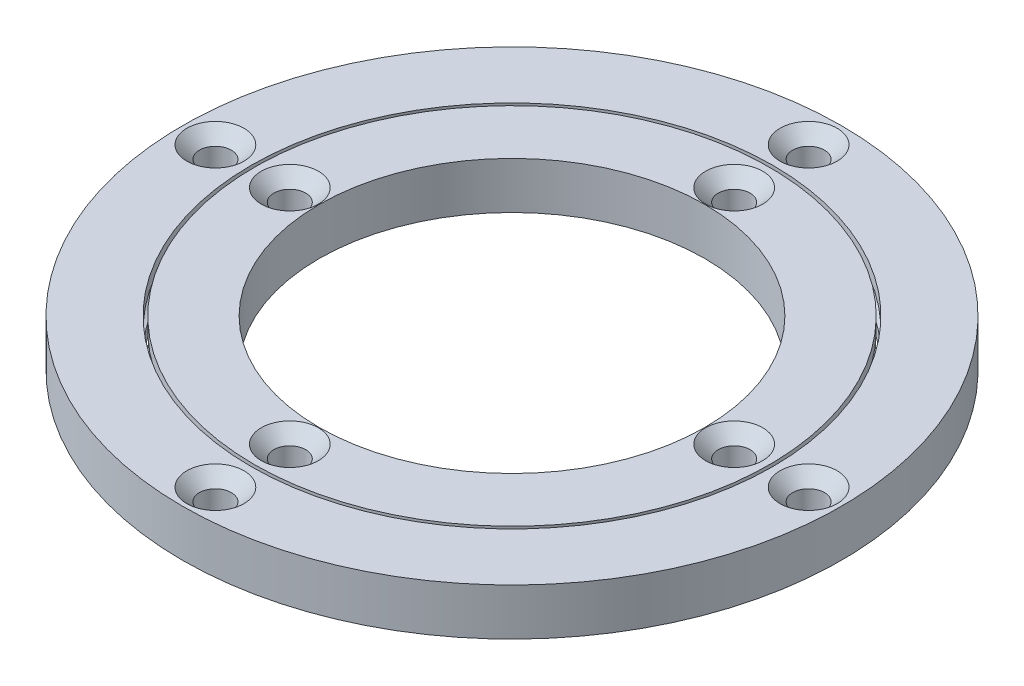
ISO-10303-21;
HEADER;
FILE_DESCRIPTION(('STEP AP214'),'2;1');
FILE_NAME('part.step','',(''),(''),'','','');
FILE_SCHEMA(('AUTOMOTIVE_DESIGN { 1 0 10303 214 1 1 1 1 }'));
ENDSEC;
DATA;
#1=APPLICATION_CONTEXT('core data for automotive mechanical design processes');
#2=APPLICATION_PROTOCOL_DEFINITION('international standard','automotive_design',2000,#1);
#3=PRODUCT_CONTEXT('',#1,'mechanical');
#4=PRODUCT('Part','Part','',(#3));
#5=PRODUCT_RELATED_PRODUCT_CATEGORY('part','',(#4));
#6=PRODUCT_DEFINITION_FORMATION('','',#4);
#7=PRODUCT_DEFINITION_CONTEXT('part definition',#1,'design');
#8=PRODUCT_DEFINITION('design','',#6,#7);
#9=PRODUCT_DEFINITION_SHAPE('','',#8);
#10=(LENGTH_UNIT() NAMED_UNIT(*) SI_UNIT(.MILLI.,.METRE.));
#11=(NAMED_UNIT(*) PLANE_ANGLE_UNIT() SI_UNIT($,.RADIAN.));
#12=(NAMED_UNIT(*) SI_UNIT($,.STERADIAN.) SOLID_ANGLE_UNIT());
#13=UNCERTAINTY_MEASURE_WITH_UNIT(LENGTH_MEASURE(1.E-05),#10,'distance_accuracy_value','');
#14=(GEOMETRIC_REPRESENTATION_CONTEXT(3) GLOBAL_UNCERTAINTY_ASSIGNED_CONTEXT((#13)) GLOBAL_UNIT_ASSIGNED_CONTEXT((#10,
#11,#12)) REPRESENTATION_CONTEXT('',''));
#15=CARTESIAN_POINT('',(0.,0.,0.));
#16=DIRECTION('',(0.,0.,1.));
#17=DIRECTION('',(1.,0.,0.));
#18=AXIS2_PLACEMENT_3D('',#15,#16,#17);
#19=CARTESIAN_POINT('',(0.,141.154947879349,0.));
#20=DIRECTION('',(0.,-1.,0.));
#21=DIRECTION('',(0.,0.,-1.));
#22=AXIS2_PLACEMENT_3D('',#19,#20,#21);
#23=CYLINDRICAL_SURFACE('',#22,46.89);
#24=CARTESIAN_POINT('',(0.,6.2416069412,0.));
#25=DIRECTION('',(0.,-1.,0.));
#26=DIRECTION('',(0.,0.,-1.));
#27=AXIS2_PLACEMENT_3D('',#24,#25,#26);
#28=CIRCLE('',#27,46.89);
#29=CARTESIAN_POINT('',(0.,6.2416069412,46.89));
#30=VERTEX_POINT('',#29);
#31=EDGE_CURVE('E13',#30,#30,#28,.F.);
#32=ORIENTED_EDGE('',*,*,#31,.T.);
#33=EDGE_LOOP('',(#32));
#34=FACE_BOUND('',#33,.T.);
#35=CARTESIAN_POINT('',(0.,8.53000000000001,0.));
#36=DIRECTION('',(0.,1.,0.));
#37=DIRECTION('',(0.,0.,1.));
#38=AXIS2_PLACEMENT_3D('',#35,#36,#37);
#39=CIRCLE('',#38,46.89);
#40=CARTESIAN_POINT('',(0.,8.53000000000001,46.89));
#41=VERTEX_POINT('',#40);
#42=EDGE_CURVE('E86',#41,#41,#39,.T.);
#43=ORIENTED_EDGE('',*,*,#42,.F.);
#44=EDGE_LOOP('',(#43));
#45=FACE_BOUND('',#44,.T.);
#46=ADVANCED_FACE('F57',(#34,#45),#23,.T.);
#47=CARTESIAN_POINT('',(0.,2.2883930588,0.));
#48=DIRECTION('',(0.,1.,0.));
#49=DIRECTION('',(0.,0.,1.));
#50=AXIS2_PLACEMENT_3D('',#47,#48,#49);
#51=CIRCLE('',#50,46.89);
#52=CARTESIAN_POINT('',(0.,2.2883930588,46.89));
#53=VERTEX_POINT('',#52);
#54=EDGE_CURVE('E65',#53,#53,#51,.F.);
#55=ORIENTED_EDGE('',*,*,#54,.T.);
#56=EDGE_LOOP('',(#55));
#57=FACE_BOUND('',#56,.T.);
#58=CARTESIAN_POINT('',(0.,0.,0.));
#59=DIRECTION('',(0.,1.,0.));
#60=DIRECTION('',(0.,0.,1.));
#61=AXIS2_PLACEMENT_3D('',#58,#59,#60);
#62=CIRCLE('',#61,46.89);
#63=CARTESIAN_POINT('',(0.,0.,46.89));
#64=VERTEX_POINT('',#63);
#65=EDGE_CURVE('E89',#64,#64,#62,.T.);
#66=ORIENTED_EDGE('',*,*,#65,.T.);
#67=EDGE_LOOP('',(#66));
#68=FACE_BOUND('',#67,.T.);
#69=ADVANCED_FACE('F59',(#57,#68),#23,.T.);
#70=CARTESIAN_POINT('',(0.,0.,0.));
#71=DIRECTION('',(0.,1.,0.));
#72=DIRECTION('',(0.,0.,1.));
#73=AXIS2_PLACEMENT_3D('',#70,#71,#72);
#74=PLANE('',#73);
#75=CARTESIAN_POINT('',(0.,0.,-40.4500000000001));
#76=DIRECTION('',(0.,1.,0.));
#77=DIRECTION('',(0.,0.,1.));
#78=AXIS2_PLACEMENT_3D('',#75,#76,#77);
#79=CIRCLE('',#78,2.9);
#80=CARTESIAN_POINT('',(0.,0.,-37.5500000000001));
#81=VERTEX_POINT('',#80);
#82=EDGE_CURVE('E245',#81,#81,#79,.T.);
#83=ORIENTED_EDGE('',*,*,#82,.T.);
#84=EDGE_LOOP('',(#83));
#85=FACE_BOUND('',#84,.T.);
#86=CARTESIAN_POINT('',(40.4500000000001,0.,0.));
#87=DIRECTION('',(0.,1.,0.));
#88=DIRECTION('',(0.,0.,1.));
#89=AXIS2_PLACEMENT_3D('',#86,#87,#88);
#90=CIRCLE('',#89,2.9);
#91=CARTESIAN_POINT('',(40.4500000000001,0.,2.9));
#92=VERTEX_POINT('',#91);
#93=EDGE_CURVE('E256',#92,#92,#90,.T.);
#94=ORIENTED_EDGE('',*,*,#93,.T.);
#95=EDGE_LOOP('',(#94));
#96=FACE_BOUND('',#95,.T.);
#97=CARTESIAN_POINT('',(-40.4500000000001,0.,0.));
#98=DIRECTION('',(0.,1.,0.));
#99=DIRECTION('',(0.,0.,1.));
#100=AXIS2_PLACEMENT_3D('',#97,#98,#99);
#101=CIRCLE('',#100,2.9);
#102=CARTESIAN_POINT('',(-40.4500000000001,0.,2.90000000000001));
#103=VERTEX_POINT('',#102);
#104=EDGE_CURVE('E265',#103,#103,#101,.T.);
#105=ORIENTED_EDGE('',*,*,#104,.T.);
#106=EDGE_LOOP('',(#105));
#107=FACE_BOUND('',#106,.T.);
#108=CARTESIAN_POINT('',(0.,0.,40.4500000000001));
#109=DIRECTION('',(0.,1.,0.));
#110=DIRECTION('',(0.,0.,1.));
#111=AXIS2_PLACEMENT_3D('',#108,#109,#110);
#112=CIRCLE('',#111,2.9);
#113=CARTESIAN_POINT('',(0.,0.,43.3500000000001));
#114=VERTEX_POINT('',#113);
#115=EDGE_CURVE('E76',#114,#114,#112,.T.);
#116=ORIENTED_EDGE('',*,*,#115,.T.);
#117=EDGE_LOOP('',(#116));
#118=FACE_BOUND('',#117,.T.);
#119=ORIENTED_EDGE('',*,*,#65,.F.);
#120=EDGE_LOOP('',(#119));
#121=FACE_BOUND('',#120,.T.);
#122=CARTESIAN_POINT('',(0.,0.,0.));
#123=DIRECTION('',(0.,1.,0.));
#124=DIRECTION('',(0.,0.,1.));
#125=AXIS2_PLACEMENT_3D('',#122,#123,#124);
#126=CIRCLE('',#125,35.135);
#127=CARTESIAN_POINT('',(0.,0.,35.135));
#128=VERTEX_POINT('',#127);
#129=EDGE_CURVE('E79',#128,#128,#126,.T.);
#130=ORIENTED_EDGE('',*,*,#129,.T.);
#131=EDGE_LOOP('',(#130));
#132=FACE_BOUND('',#131,.T.);
#133=ADVANCED_FACE('F96',(#85,#96,#107,#118,#121,#132),#74,.F.);
#134=CARTESIAN_POINT('',(0.,141.154947879349,0.));
#135=DIRECTION('',(0.,-1.,0.));
#136=DIRECTION('',(0.,0.,-1.));
#137=AXIS2_PLACEMENT_3D('',#134,#135,#136);
#138=CYLINDRICAL_SURFACE('',#137,35.135);
#139=ORIENTED_EDGE('',*,*,#129,.F.);
#140=EDGE_LOOP('',(#139));
#141=FACE_BOUND('',#140,.T.);
#142=CARTESIAN_POINT('',(0.,8.53000000000001,0.));
#143=DIRECTION('',(0.,1.,0.));
#144=DIRECTION('',(0.,0.,1.));
#145=AXIS2_PLACEMENT_3D('',#142,#143,#144);
#146=CIRCLE('',#145,35.135);
#147=CARTESIAN_POINT('',(0.,8.53000000000001,35.135));
#148=VERTEX_POINT('',#147);
#149=EDGE_CURVE('E75',#148,#148,#146,.T.);
#150=ORIENTED_EDGE('',*,*,#149,.T.);
#151=EDGE_LOOP('',(#150));
#152=FACE_BOUND('',#151,.T.);
#153=ADVANCED_FACE('F101',(#141,#152),#138,.F.);
#154=CARTESIAN_POINT('',(0.,8.53,0.));
#155=DIRECTION('',(0.,1.,0.));
#156=DIRECTION('',(0.,0.,1.));
#157=AXIS2_PLACEMENT_3D('',#154,#155,#156);
#158=PLANE('',#157);
#159=CARTESIAN_POINT('',(0.,8.53,-40.4500000000001));
#160=DIRECTION('',(0.,1.,0.));
#161=DIRECTION('',(0.,0.,1.));
#162=AXIS2_PLACEMENT_3D('',#159,#160,#161);
#163=CIRCLE('',#162,5.2);
#164=CARTESIAN_POINT('',(0.,8.53,-35.2500000000001));
#165=VERTEX_POINT('',#164);
#166=EDGE_CURVE('E243',#165,#165,#163,.T.);
#167=ORIENTED_EDGE('',*,*,#166,.F.);
#168=EDGE_LOOP('',(#167));
#169=FACE_BOUND('',#168,.T.);
#170=CARTESIAN_POINT('',(40.4500000000001,8.53,0.));
#171=DIRECTION('',(0.,1.,0.));
#172=DIRECTION('',(0.,0.,1.));
#173=AXIS2_PLACEMENT_3D('',#170,#171,#172);
#174=CIRCLE('',#173,5.2);
#175=CARTESIAN_POINT('',(40.4500000000001,8.53,5.2));
#176=VERTEX_POINT('',#175);
#177=EDGE_CURVE('E250',#176,#176,#174,.T.);
#178=ORIENTED_EDGE('',*,*,#177,.F.);
#179=EDGE_LOOP('',(#178));
#180=FACE_BOUND('',#179,.T.);
#181=CARTESIAN_POINT('',(-40.4500000000001,8.53,0.));
#182=DIRECTION('',(0.,1.,0.));
#183=DIRECTION('',(0.,0.,1.));
#184=AXIS2_PLACEMENT_3D('',#181,#182,#183);
#185=CIRCLE('',#184,5.2);
#186=CARTESIAN_POINT('',(-40.4500000000001,8.53,5.20000000000001));
#187=VERTEX_POINT('',#186);
#188=EDGE_CURVE('E259',#187,#187,#185,.T.);
#189=ORIENTED_EDGE('',*,*,#188,.F.);
#190=EDGE_LOOP('',(#189));
#191=FACE_BOUND('',#190,.T.);
#192=CARTESIAN_POINT('',(0.,8.53,40.4500000000001));
#193=DIRECTION('',(0.,1.,0.));
#194=DIRECTION('',(0.,0.,1.));
#195=AXIS2_PLACEMENT_3D('',#192,#193,#194);
#196=CIRCLE('',#195,5.2);
#197=CARTESIAN_POINT('',(0.,8.53,45.6500000000001));
#198=VERTEX_POINT('',#197);
#199=EDGE_CURVE('E268',#198,#198,#196,.T.);
#200=ORIENTED_EDGE('',*,*,#199,.F.);
#201=EDGE_LOOP('',(#200));
#202=FACE_BOUND('',#201,.T.);
#203=ORIENTED_EDGE('',*,*,#149,.F.);
#204=EDGE_LOOP('',(#203));
#205=FACE_BOUND('',#204,.T.);
#206=ORIENTED_EDGE('',*,*,#42,.T.);
#207=EDGE_LOOP('',(#206));
#208=FACE_BOUND('',#207,.T.);
#209=ADVANCED_FACE('F107',(#169,#180,#191,#202,#205,#208),#158,.T.);
#210=CARTESIAN_POINT('',(0.,4.265,0.));
#211=DIRECTION('',(0.,1.,0.));
#212=DIRECTION('',(0.,0.,1.));
#213=AXIS2_PLACEMENT_3D('',#210,#211,#212);
#214=TOROIDAL_SURFACE('',#213,47.195,2.);
#215=CARTESIAN_POINT('',(0.,4.265,47.195));
#216=DIRECTION('',(1.,0.,0.));
#217=DIRECTION('',(0.,0.,-1.));
#218=AXIS2_PLACEMENT_3D('',#215,#216,#217);
#219=CIRCLE('',#218,2.);
#220=EDGE_CURVE('E72',#53,#30,#219,.T.);
#221=ORIENTED_EDGE('',*,*,#220,.F.);
#222=ORIENTED_EDGE('',*,*,#54,.F.);
#223=ORIENTED_EDGE('',*,*,#220,.T.);
#224=ORIENTED_EDGE('',*,*,#31,.F.);
#225=EDGE_LOOP('',(#221,#222,#223,#224));
#226=FACE_BOUND('',#225,.T.);
#227=ADVANCED_FACE('F73',(#226),#214,.F.);
#228=CARTESIAN_POINT('',(0.,8.53,40.4500000000001));
#229=DIRECTION('',(0.,1.,0.));
#230=DIRECTION('',(0.,0.,1.));
#231=AXIS2_PLACEMENT_3D('',#228,#229,#230);
#232=CYLINDRICAL_SURFACE('',#231,2.9);
#233=ORIENTED_EDGE('',*,*,#115,.F.);
#234=EDGE_LOOP('',(#233));
#235=FACE_BOUND('',#234,.T.);
#236=CARTESIAN_POINT('',(0.,6.23,40.4500000000001));
#237=DIRECTION('',(0.,1.,0.));
#238=DIRECTION('',(0.,0.,1.));
#239=AXIS2_PLACEMENT_3D('',#236,#237,#238);
#240=CIRCLE('',#239,2.9);
#241=CARTESIAN_POINT('',(0.,6.23,43.3500000000001));
#242=VERTEX_POINT('',#241);
#243=EDGE_CURVE('E82',#242,#242,#240,.T.);
#244=ORIENTED_EDGE('',*,*,#243,.T.);
#245=EDGE_LOOP('',(#244));
#246=FACE_BOUND('',#245,.T.);
#247=ADVANCED_FACE('F144',(#235,#246),#232,.F.);
#248=CARTESIAN_POINT('',(0.,8.53,40.4500000000001));
#249=DIRECTION('',(0.,1.,0.));
#250=DIRECTION('',(0.,0.,1.));
#251=AXIS2_PLACEMENT_3D('',#248,#249,#250);
#252=CONICAL_SURFACE('',#251,5.2,0.785398163397449);
#253=ORIENTED_EDGE('',*,*,#243,.F.);
#254=EDGE_LOOP('',(#253));
#255=FACE_BOUND('',#254,.T.);
#256=ORIENTED_EDGE('',*,*,#199,.T.);
#257=EDGE_LOOP('',(#256));
#258=FACE_BOUND('',#257,.T.);
#259=ADVANCED_FACE('F150',(#255,#258),#252,.F.);
#260=CARTESIAN_POINT('',(-40.4500000000001,8.53,0.));
#261=DIRECTION('',(0.,1.,0.));
#262=DIRECTION('',(0.,0.,1.));
#263=AXIS2_PLACEMENT_3D('',#260,#261,#262);
#264=CYLINDRICAL_SURFACE('',#263,2.9);
#265=ORIENTED_EDGE('',*,*,#104,.F.);
#266=EDGE_LOOP('',(#265));
#267=FACE_BOUND('',#266,.T.);
#268=CARTESIAN_POINT('',(-40.4500000000001,6.23,0.));
#269=DIRECTION('',(0.,1.,0.));
#270=DIRECTION('',(0.,0.,1.));
#271=AXIS2_PLACEMENT_3D('',#268,#269,#270);
#272=CIRCLE('',#271,2.9);
#273=CARTESIAN_POINT('',(-40.4500000000001,6.23,2.90000000000001));
#274=VERTEX_POINT('',#273);
#275=EDGE_CURVE('E262',#274,#274,#272,.T.);
#276=ORIENTED_EDGE('',*,*,#275,.T.);
#277=EDGE_LOOP('',(#276));
#278=FACE_BOUND('',#277,.T.);
#279=ADVANCED_FACE('F158',(#267,#278),#264,.F.);
#280=CARTESIAN_POINT('',(-40.4500000000001,8.53,0.));
#281=DIRECTION('',(0.,1.,0.));
#282=DIRECTION('',(0.,0.,1.));
#283=AXIS2_PLACEMENT_3D('',#280,#281,#282);
#284=CONICAL_SURFACE('',#283,5.2,0.785398163397449);
#285=ORIENTED_EDGE('',*,*,#275,.F.);
#286=EDGE_LOOP('',(#285));
#287=FACE_BOUND('',#286,.T.);
#288=ORIENTED_EDGE('',*,*,#188,.T.);
#289=EDGE_LOOP('',(#288));
#290=FACE_BOUND('',#289,.T.);
#291=ADVANCED_FACE('F166',(#287,#290),#284,.F.);
#292=CARTESIAN_POINT('',(40.4500000000001,8.53,0.));
#293=DIRECTION('',(0.,1.,0.));
#294=DIRECTION('',(0.,0.,1.));
#295=AXIS2_PLACEMENT_3D('',#292,#293,#294);
#296=CYLINDRICAL_SURFACE('',#295,2.9);
#297=ORIENTED_EDGE('',*,*,#93,.F.);
#298=EDGE_LOOP('',(#297));
#299=FACE_BOUND('',#298,.T.);
#300=CARTESIAN_POINT('',(40.4500000000001,6.23,0.));
#301=DIRECTION('',(0.,1.,0.));
#302=DIRECTION('',(0.,0.,1.));
#303=AXIS2_PLACEMENT_3D('',#300,#301,#302);
#304=CIRCLE('',#303,2.9);
#305=CARTESIAN_POINT('',(40.4500000000001,6.23,2.9));
#306=VERTEX_POINT('',#305);
#307=EDGE_CURVE('E253',#306,#306,#304,.T.);
#308=ORIENTED_EDGE('',*,*,#307,.T.);
#309=EDGE_LOOP('',(#308));
#310=FACE_BOUND('',#309,.T.);
#311=ADVANCED_FACE('F174',(#299,#310),#296,.F.);
#312=CARTESIAN_POINT('',(40.4500000000001,8.53,0.));
#313=DIRECTION('',(0.,1.,0.));
#314=DIRECTION('',(0.,0.,1.));
#315=AXIS2_PLACEMENT_3D('',#312,#313,#314);
#316=CONICAL_SURFACE('',#315,5.2,0.785398163397449);
#317=ORIENTED_EDGE('',*,*,#307,.F.);
#318=EDGE_LOOP('',(#317));
#319=FACE_BOUND('',#318,.T.);
#320=ORIENTED_EDGE('',*,*,#177,.T.);
#321=EDGE_LOOP('',(#320));
#322=FACE_BOUND('',#321,.T.);
#323=ADVANCED_FACE('F182',(#319,#322),#316,.F.);
#324=CARTESIAN_POINT('',(0.,8.53,-40.4500000000001));
#325=DIRECTION('',(0.,1.,0.));
#326=DIRECTION('',(0.,0.,1.));
#327=AXIS2_PLACEMENT_3D('',#324,#325,#326);
#328=CYLINDRICAL_SURFACE('',#327,2.9);
#329=ORIENTED_EDGE('',*,*,#82,.F.);
#330=EDGE_LOOP('',(#329));
#331=FACE_BOUND('',#330,.T.);
#332=CARTESIAN_POINT('',(0.,6.23,-40.4500000000001));
#333=DIRECTION('',(0.,1.,0.));
#334=DIRECTION('',(0.,0.,1.));
#335=AXIS2_PLACEMENT_3D('',#332,#333,#334);
#336=CIRCLE('',#335,2.9);
#337=CARTESIAN_POINT('',(0.,6.23,-37.5500000000001));
#338=VERTEX_POINT('',#337);
#339=EDGE_CURVE('E240',#338,#338,#336,.T.);
#340=ORIENTED_EDGE('',*,*,#339,.T.);
#341=EDGE_LOOP('',(#340));
#342=FACE_BOUND('',#341,.T.);
#343=ADVANCED_FACE('F190',(#331,#342),#328,.F.);
#344=CARTESIAN_POINT('',(0.,8.53,-40.4500000000001));
#345=DIRECTION('',(0.,1.,0.));
#346=DIRECTION('',(0.,0.,1.));
#347=AXIS2_PLACEMENT_3D('',#344,#345,#346);
#348=CONICAL_SURFACE('',#347,5.2,0.785398163397449);
#349=ORIENTED_EDGE('',*,*,#339,.F.);
#350=EDGE_LOOP('',(#349));
#351=FACE_BOUND('',#350,.T.);
#352=ORIENTED_EDGE('',*,*,#166,.T.);
#353=EDGE_LOOP('',(#352));
#354=FACE_BOUND('',#353,.T.);
#355=ADVANCED_FACE('F198',(#351,#354),#348,.F.);
#356=CLOSED_SHELL('',(#46,#69,#133,#153,#209,#227,#247,#259,#279,#291,#311,#323,#343,#355));
#357=MANIFOLD_SOLID_BREP('B2',#356);
#358=CARTESIAN_POINT('',(0.,8.53,0.));
#359=DIRECTION('',(0.,-1.,0.));
#360=DIRECTION('',(0.,0.,-1.));
#361=AXIS2_PLACEMENT_3D('',#358,#359,#360);
#362=CYLINDRICAL_SURFACE('',#361,47.5);
#363=CARTESIAN_POINT('',(0.,6.2416069412,0.));
#364=DIRECTION('',(0.,-1.,0.));
#365=DIRECTION('',(0.,0.,-1.));
#366=AXIS2_PLACEMENT_3D('',#363,#364,#365);
#367=CIRCLE('',#366,47.5);
#368=CARTESIAN_POINT('',(0.,6.2416069412,47.5));
#369=VERTEX_POINT('',#368);
#370=EDGE_CURVE('E55',#369,#369,#367,.F.);
#371=ORIENTED_EDGE('',*,*,#370,.F.);
#372=EDGE_LOOP('',(#371));
#373=FACE_BOUND('',#372,.T.);
#374=CARTESIAN_POINT('',(0.,8.53,0.));
#375=DIRECTION('',(0.,1.,0.));
#376=DIRECTION('',(0.,0.,1.));
#377=AXIS2_PLACEMENT_3D('',#374,#375,#376);
#378=CIRCLE('',#377,47.5);
#379=CARTESIAN_POINT('',(0.,8.53,47.5));
#380=VERTEX_POINT('',#379);
#381=EDGE_CURVE('E319',#380,#380,#378,.T.);
#382=ORIENTED_EDGE('',*,*,#381,.T.);
#383=EDGE_LOOP('',(#382));
#384=FACE_BOUND('',#383,.T.);
#385=ADVANCED_FACE('F297',(#373,#384),#362,.F.);
#386=CARTESIAN_POINT('',(0.,8.53,0.));
#387=DIRECTION('',(0.,1.,0.));
#388=DIRECTION('',(0.,0.,1.));
#389=AXIS2_PLACEMENT_3D('',#386,#387,#388);
#390=PLANE('',#389);
#391=CARTESIAN_POINT('',(0.,8.53,-53.999999997));
#392=DIRECTION('',(0.,1.,0.));
#393=DIRECTION('',(0.,0.,1.));
#394=AXIS2_PLACEMENT_3D('',#391,#392,#393);
#395=CIRCLE('',#394,5.2);
#396=CARTESIAN_POINT('',(0.,8.53,-48.799999997));
#397=VERTEX_POINT('',#396);
#398=EDGE_CURVE('E369',#397,#397,#395,.T.);
#399=ORIENTED_EDGE('',*,*,#398,.F.);
#400=EDGE_LOOP('',(#399));
#401=FACE_BOUND('',#400,.T.);
#402=CARTESIAN_POINT('',(53.999999997,8.53,0.));
#403=DIRECTION('',(0.,1.,0.));
#404=DIRECTION('',(0.,0.,1.));
#405=AXIS2_PLACEMENT_3D('',#402,#403,#404);
#406=CIRCLE('',#405,5.2);
#407=CARTESIAN_POINT('',(53.999999997,8.53,5.2));
#408=VERTEX_POINT('',#407);
#409=EDGE_CURVE('E373',#408,#408,#406,.T.);
#410=ORIENTED_EDGE('',*,*,#409,.F.);
#411=EDGE_LOOP('',(#410));
#412=FACE_BOUND('',#411,.T.);
#413=CARTESIAN_POINT('',(-53.999999997,8.53,0.));
#414=DIRECTION('',(0.,1.,0.));
#415=DIRECTION('',(0.,0.,1.));
#416=AXIS2_PLACEMENT_3D('',#413,#414,#415);
#417=CIRCLE('',#416,5.2);
#418=CARTESIAN_POINT('',(-53.999999997,8.53,5.20000000000001));
#419=VERTEX_POINT('',#418);
#420=EDGE_CURVE('E377',#419,#419,#417,.T.);
#421=ORIENTED_EDGE('',*,*,#420,.F.);
#422=EDGE_LOOP('',(#421));
#423=FACE_BOUND('',#422,.T.);
#424=CARTESIAN_POINT('',(0.,8.53,53.999999997));
#425=DIRECTION('',(0.,1.,0.));
#426=DIRECTION('',(0.,0.,1.));
#427=AXIS2_PLACEMENT_3D('',#424,#425,#426);
#428=CIRCLE('',#427,5.2);
#429=CARTESIAN_POINT('',(0.,8.53,59.199999997));
#430=VERTEX_POINT('',#429);
#431=EDGE_CURVE('E381',#430,#430,#428,.T.);
#432=ORIENTED_EDGE('',*,*,#431,.F.);
#433=EDGE_LOOP('',(#432));
#434=FACE_BOUND('',#433,.T.);
#435=CARTESIAN_POINT('',(0.,8.53,0.));
#436=DIRECTION('',(0.,1.,0.));
#437=DIRECTION('',(0.,0.,1.));
#438=AXIS2_PLACEMENT_3D('',#435,#436,#437);
#439=CIRCLE('',#438,60.);
#440=CARTESIAN_POINT('',(0.,8.53,60.));
#441=VERTEX_POINT('',#440);
#442=EDGE_CURVE('E329',#441,#441,#439,.T.);
#443=ORIENTED_EDGE('',*,*,#442,.T.);
#444=EDGE_LOOP('',(#443));
#445=FACE_BOUND('',#444,.T.);
#446=ORIENTED_EDGE('',*,*,#381,.F.);
#447=EDGE_LOOP('',(#446));
#448=FACE_BOUND('',#447,.T.);
#449=ADVANCED_FACE('F339',(#401,#412,#423,#434,#445,#448),#390,.T.);
#450=CARTESIAN_POINT('',(0.,0.,0.));
#451=DIRECTION('',(0.,1.,0.));
#452=DIRECTION('',(0.,0.,1.));
#453=AXIS2_PLACEMENT_3D('',#450,#451,#452);
#454=PLANE('',#453);
#455=CARTESIAN_POINT('',(0.,0.,-53.999999997));
#456=DIRECTION('',(0.,1.,0.));
#457=DIRECTION('',(0.,0.,1.));
#458=AXIS2_PLACEMENT_3D('',#455,#456,#457);
#459=CIRCLE('',#458,2.9);
#460=CARTESIAN_POINT('',(0.,0.,-51.099999997));
#461=VERTEX_POINT('',#460);
#462=EDGE_CURVE('E401',#461,#461,#459,.T.);
#463=ORIENTED_EDGE('',*,*,#462,.T.);
#464=EDGE_LOOP('',(#463));
#465=FACE_BOUND('',#464,.T.);
#466=CARTESIAN_POINT('',(53.999999997,0.,0.));
#467=DIRECTION('',(0.,1.,0.));
#468=DIRECTION('',(0.,0.,1.));
#469=AXIS2_PLACEMENT_3D('',#466,#467,#468);
#470=CIRCLE('',#469,2.9);
#471=CARTESIAN_POINT('',(53.999999997,0.,2.9));
#472=VERTEX_POINT('',#471);
#473=EDGE_CURVE('E394',#472,#472,#470,.T.);
#474=ORIENTED_EDGE('',*,*,#473,.T.);
#475=EDGE_LOOP('',(#474));
#476=FACE_BOUND('',#475,.T.);
#477=CARTESIAN_POINT('',(-53.999999997,0.,0.));
#478=DIRECTION('',(0.,1.,0.));
#479=DIRECTION('',(0.,0.,1.));
#480=AXIS2_PLACEMENT_3D('',#477,#478,#479);
#481=CIRCLE('',#480,2.9);
#482=CARTESIAN_POINT('',(-53.999999997,0.,2.90000000000001));
#483=VERTEX_POINT('',#482);
#484=EDGE_CURVE('E384',#483,#483,#481,.T.);
#485=ORIENTED_EDGE('',*,*,#484,.T.);
#486=EDGE_LOOP('',(#485));
#487=FACE_BOUND('',#486,.T.);
#488=CARTESIAN_POINT('',(0.,0.,53.999999997));
#489=DIRECTION('',(0.,1.,0.));
#490=DIRECTION('',(0.,0.,1.));
#491=AXIS2_PLACEMENT_3D('',#488,#489,#490);
#492=CIRCLE('',#491,2.9);
#493=CARTESIAN_POINT('',(0.,0.,56.899999997));
#494=VERTEX_POINT('',#493);
#495=EDGE_CURVE('E316',#494,#494,#492,.T.);
#496=ORIENTED_EDGE('',*,*,#495,.T.);
#497=EDGE_LOOP('',(#496));
#498=FACE_BOUND('',#497,.T.);
#499=CARTESIAN_POINT('',(0.,0.,0.));
#500=DIRECTION('',(0.,1.,0.));
#501=DIRECTION('',(0.,0.,1.));
#502=AXIS2_PLACEMENT_3D('',#499,#500,#501);
#503=CIRCLE('',#502,60.);
#504=CARTESIAN_POINT('',(0.,0.,60.));
#505=VERTEX_POINT('',#504);
#506=EDGE_CURVE('E327',#505,#505,#503,.T.);
#507=ORIENTED_EDGE('',*,*,#506,.F.);
#508=EDGE_LOOP('',(#507));
#509=FACE_BOUND('',#508,.T.);
#510=CARTESIAN_POINT('',(0.,0.,0.));
#511=DIRECTION('',(0.,1.,0.));
#512=DIRECTION('',(0.,0.,1.));
#513=AXIS2_PLACEMENT_3D('',#510,#511,#512);
#514=CIRCLE('',#513,47.5);
#515=CARTESIAN_POINT('',(0.,0.,47.5));
#516=VERTEX_POINT('',#515);
#517=EDGE_CURVE('E315',#516,#516,#514,.T.);
#518=ORIENTED_EDGE('',*,*,#517,.T.);
#519=EDGE_LOOP('',(#518));
#520=FACE_BOUND('',#519,.T.);
#521=ADVANCED_FACE('F336',(#465,#476,#487,#498,#509,#520),#454,.F.);
#522=CARTESIAN_POINT('',(0.,8.53,0.));
#523=DIRECTION('',(0.,-1.,0.));
#524=DIRECTION('',(0.,0.,-1.));
#525=AXIS2_PLACEMENT_3D('',#522,#523,#524);
#526=CYLINDRICAL_SURFACE('',#525,60.);
#527=ORIENTED_EDGE('',*,*,#442,.F.);
#528=EDGE_LOOP('',(#527));
#529=FACE_BOUND('',#528,.T.);
#530=ORIENTED_EDGE('',*,*,#506,.T.);
#531=EDGE_LOOP('',(#530));
#532=FACE_BOUND('',#531,.T.);
#533=ADVANCED_FACE('F299',(#529,#532),#526,.T.);
#534=CARTESIAN_POINT('',(0.,2.2883930588,0.));
#535=DIRECTION('',(0.,1.,0.));
#536=DIRECTION('',(0.,0.,1.));
#537=AXIS2_PLACEMENT_3D('',#534,#535,#536);
#538=CIRCLE('',#537,47.5);
#539=CARTESIAN_POINT('',(0.,2.2883930588,47.5));
#540=VERTEX_POINT('',#539);
#541=EDGE_CURVE('E305',#540,#540,#538,.F.);
#542=ORIENTED_EDGE('',*,*,#541,.F.);
#543=EDGE_LOOP('',(#542));
#544=FACE_BOUND('',#543,.T.);
#545=ORIENTED_EDGE('',*,*,#517,.F.);
#546=EDGE_LOOP('',(#545));
#547=FACE_BOUND('',#546,.T.);
#548=ADVANCED_FACE('F343',(#544,#547),#362,.F.);
#549=CARTESIAN_POINT('',(0.,4.265,0.));
#550=DIRECTION('',(0.,1.,0.));
#551=DIRECTION('',(0.,0.,1.));
#552=AXIS2_PLACEMENT_3D('',#549,#550,#551);
#553=TOROIDAL_SURFACE('',#552,47.195,2.);
#554=ORIENTED_EDGE('',*,*,#370,.T.);
#555=CARTESIAN_POINT('',(0.,4.265,47.195));
#556=DIRECTION('',(1.,0.,0.));
#557=DIRECTION('',(0.,0.,-1.));
#558=AXIS2_PLACEMENT_3D('',#555,#556,#557);
#559=CIRCLE('',#558,2.);
#560=EDGE_CURVE('E311',#369,#540,#559,.T.);
#561=ORIENTED_EDGE('',*,*,#560,.T.);
#562=ORIENTED_EDGE('',*,*,#541,.T.);
#563=ORIENTED_EDGE('',*,*,#560,.F.);
#564=EDGE_LOOP('',(#554,#561,#562,#563));
#565=FACE_BOUND('',#564,.T.);
#566=ADVANCED_FACE('F312',(#565),#553,.F.);
#567=CARTESIAN_POINT('',(0.,8.53,53.999999997));
#568=DIRECTION('',(0.,1.,0.));
#569=DIRECTION('',(0.,0.,1.));
#570=AXIS2_PLACEMENT_3D('',#567,#568,#569);
#571=CYLINDRICAL_SURFACE('',#570,2.9);
#572=ORIENTED_EDGE('',*,*,#495,.F.);
#573=EDGE_LOOP('',(#572));
#574=FACE_BOUND('',#573,.T.);
#575=CARTESIAN_POINT('',(0.,6.23,53.999999997));
#576=DIRECTION('',(0.,1.,0.));
#577=DIRECTION('',(0.,0.,1.));
#578=AXIS2_PLACEMENT_3D('',#575,#576,#577);
#579=CIRCLE('',#578,2.9);
#580=CARTESIAN_POINT('',(0.,6.23,56.899999997));
#581=VERTEX_POINT('',#580);
#582=EDGE_CURVE('E322',#581,#581,#579,.T.);
#583=ORIENTED_EDGE('',*,*,#582,.T.);
#584=EDGE_LOOP('',(#583));
#585=FACE_BOUND('',#584,.T.);
#586=ADVANCED_FACE('F351',(#574,#585),#571,.F.);
#587=CARTESIAN_POINT('',(0.,8.53,53.999999997));
#588=DIRECTION('',(0.,1.,0.));
#589=DIRECTION('',(0.,0.,1.));
#590=AXIS2_PLACEMENT_3D('',#587,#588,#589);
#591=CONICAL_SURFACE('',#590,5.2,0.785398163397449);
#592=ORIENTED_EDGE('',*,*,#582,.F.);
#593=EDGE_LOOP('',(#592));
#594=FACE_BOUND('',#593,.T.);
#595=ORIENTED_EDGE('',*,*,#431,.T.);
#596=EDGE_LOOP('',(#595));
#597=FACE_BOUND('',#596,.T.);
#598=ADVANCED_FACE('F435',(#594,#597),#591,.F.);
#599=CARTESIAN_POINT('',(-53.999999997,8.53,0.));
#600=DIRECTION('',(0.,1.,0.));
#601=DIRECTION('',(0.,0.,1.));
#602=AXIS2_PLACEMENT_3D('',#599,#600,#601);
#603=CYLINDRICAL_SURFACE('',#602,2.9);
#604=ORIENTED_EDGE('',*,*,#484,.F.);
#605=EDGE_LOOP('',(#604));
#606=FACE_BOUND('',#605,.T.);
#607=CARTESIAN_POINT('',(-53.999999997,6.23,0.));
#608=DIRECTION('',(0.,1.,0.));
#609=DIRECTION('',(0.,0.,1.));
#610=AXIS2_PLACEMENT_3D('',#607,#608,#609);
#611=CIRCLE('',#610,2.9);
#612=CARTESIAN_POINT('',(-53.999999997,6.23,2.90000000000001));
#613=VERTEX_POINT('',#612);
#614=EDGE_CURVE('E388',#613,#613,#611,.T.);
#615=ORIENTED_EDGE('',*,*,#614,.T.);
#616=EDGE_LOOP('',(#615));
#617=FACE_BOUND('',#616,.T.);
#618=ADVANCED_FACE('F431',(#606,#617),#603,.F.);
#619=CARTESIAN_POINT('',(-53.999999997,8.53,0.));
#620=DIRECTION('',(0.,1.,0.));
#621=DIRECTION('',(0.,0.,1.));
#622=AXIS2_PLACEMENT_3D('',#619,#620,#621);
#623=CONICAL_SURFACE('',#622,5.2,0.785398163397449);
#624=ORIENTED_EDGE('',*,*,#614,.F.);
#625=EDGE_LOOP('',(#624));
#626=FACE_BOUND('',#625,.T.);
#627=ORIENTED_EDGE('',*,*,#420,.T.);
#628=EDGE_LOOP('',(#627));
#629=FACE_BOUND('',#628,.T.);
#630=ADVANCED_FACE('F427',(#626,#629),#623,.F.);
#631=CARTESIAN_POINT('',(53.999999997,8.53,0.));
#632=DIRECTION('',(0.,1.,0.));
#633=DIRECTION('',(0.,0.,1.));
#634=AXIS2_PLACEMENT_3D('',#631,#632,#633);
#635=CYLINDRICAL_SURFACE('',#634,2.9);
#636=ORIENTED_EDGE('',*,*,#473,.F.);
#637=EDGE_LOOP('',(#636));
#638=FACE_BOUND('',#637,.T.);
#639=CARTESIAN_POINT('',(53.999999997,6.23,0.));
#640=DIRECTION('',(0.,1.,0.));
#641=DIRECTION('',(0.,0.,1.));
#642=AXIS2_PLACEMENT_3D('',#639,#640,#641);
#643=CIRCLE('',#642,2.9);
#644=CARTESIAN_POINT('',(53.999999997,6.23,2.9));
#645=VERTEX_POINT('',#644);
#646=EDGE_CURVE('E397',#645,#645,#643,.T.);
#647=ORIENTED_EDGE('',*,*,#646,.T.);
#648=EDGE_LOOP('',(#647));
#649=FACE_BOUND('',#648,.T.);
#650=ADVANCED_FACE('F423',(#638,#649),#635,.F.);
#651=CARTESIAN_POINT('',(53.999999997,8.53,0.));
#652=DIRECTION('',(0.,1.,0.));
#653=DIRECTION('',(0.,0.,1.));
#654=AXIS2_PLACEMENT_3D('',#651,#652,#653);
#655=CONICAL_SURFACE('',#654,5.2,0.785398163397449);
#656=ORIENTED_EDGE('',*,*,#646,.F.);
#657=EDGE_LOOP('',(#656));
#658=FACE_BOUND('',#657,.T.);
#659=ORIENTED_EDGE('',*,*,#409,.T.);
#660=EDGE_LOOP('',(#659));
#661=FACE_BOUND('',#660,.T.);
#662=ADVANCED_FACE('F416',(#658,#661),#655,.F.);
#663=CARTESIAN_POINT('',(0.,8.53,-53.999999997));
#664=DIRECTION('',(0.,1.,0.));
#665=DIRECTION('',(0.,0.,1.));
#666=AXIS2_PLACEMENT_3D('',#663,#664,#665);
#667=CYLINDRICAL_SURFACE('',#666,2.9);
#668=ORIENTED_EDGE('',*,*,#462,.F.);
#669=EDGE_LOOP('',(#668));
#670=FACE_BOUND('',#669,.T.);
#671=CARTESIAN_POINT('',(0.,6.23,-53.999999997));
#672=DIRECTION('',(0.,1.,0.));
#673=DIRECTION('',(0.,0.,1.));
#674=AXIS2_PLACEMENT_3D('',#671,#672,#673);
#675=CIRCLE('',#674,2.9);
#676=CARTESIAN_POINT('',(0.,6.23,-51.099999997));
#677=VERTEX_POINT('',#676);
#678=EDGE_CURVE('E404',#677,#677,#675,.T.);
#679=ORIENTED_EDGE('',*,*,#678,.T.);
#680=EDGE_LOOP('',(#679));
#681=FACE_BOUND('',#680,.T.);
#682=ADVANCED_FACE('F410',(#670,#681),#667,.F.);
#683=CARTESIAN_POINT('',(0.,8.53,-53.999999997));
#684=DIRECTION('',(0.,1.,0.));
#685=DIRECTION('',(0.,0.,1.));
#686=AXIS2_PLACEMENT_3D('',#683,#684,#685);
#687=CONICAL_SURFACE('',#686,5.2,0.785398163397449);
#688=ORIENTED_EDGE('',*,*,#678,.F.);
#689=EDGE_LOOP('',(#688));
#690=FACE_BOUND('',#689,.T.);
#691=ORIENTED_EDGE('',*,*,#398,.T.);
#692=EDGE_LOOP('',(#691));
#693=FACE_BOUND('',#692,.T.);
#694=ADVANCED_FACE('F408',(#690,#693),#687,.F.);
#695=CLOSED_SHELL('',(#385,#449,#521,#533,#548,#566,#586,#598,#618,#630,#650,#662,#682,#694));
#696=MANIFOLD_SOLID_BREP('B7',#695);
#697=ADVANCED_BREP_SHAPE_REPRESENTATION('',(#18,#357,#696),#14);
#698=SHAPE_DEFINITION_REPRESENTATION(#9,#697);
ENDSEC;
END-ISO-10303-21;
